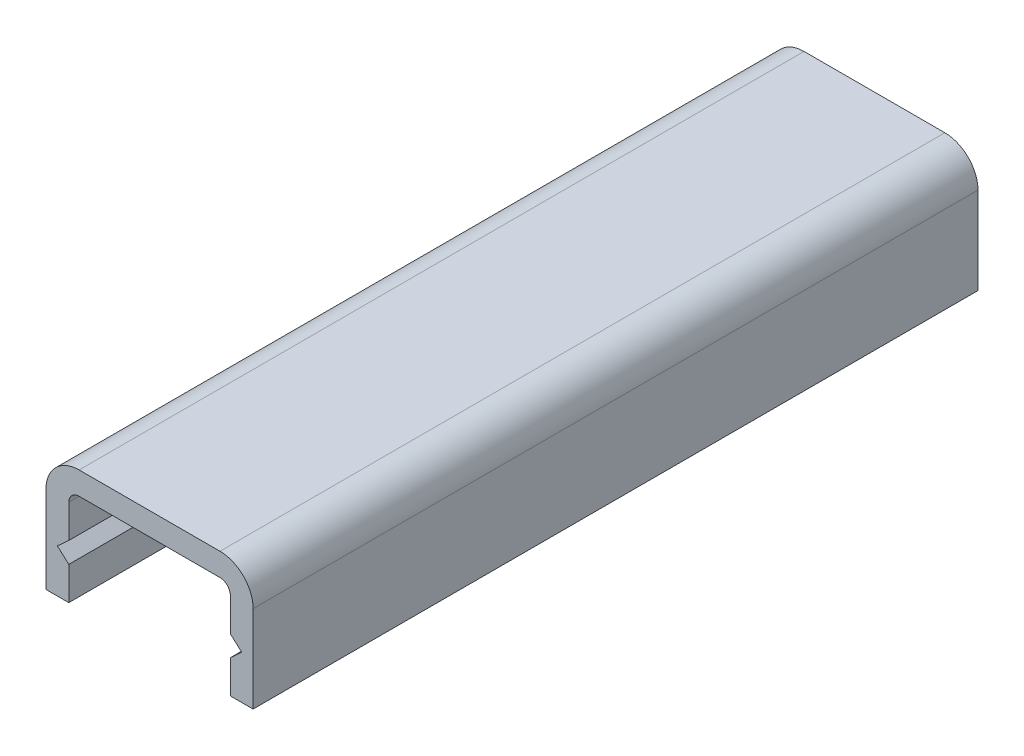
ISO-10303-21;
HEADER;
FILE_DESCRIPTION(('STEP AP214'),'2;1');
FILE_NAME('part.step','',(''),(''),'','','');
FILE_SCHEMA(('AUTOMOTIVE_DESIGN { 1 0 10303 214 1 1 1 1 }'));
ENDSEC;
DATA;
#1=APPLICATION_CONTEXT('core data for automotive mechanical design processes');
#2=APPLICATION_PROTOCOL_DEFINITION('international standard','automotive_design',2000,#1);
#3=PRODUCT_CONTEXT('',#1,'mechanical');
#4=PRODUCT('Part','Part','',(#3));
#5=PRODUCT_RELATED_PRODUCT_CATEGORY('part','',(#4));
#6=PRODUCT_DEFINITION_FORMATION('','',#4);
#7=PRODUCT_DEFINITION_CONTEXT('part definition',#1,'design');
#8=PRODUCT_DEFINITION('design','',#6,#7);
#9=PRODUCT_DEFINITION_SHAPE('','',#8);
#10=(LENGTH_UNIT() NAMED_UNIT(*) SI_UNIT(.MILLI.,.METRE.));
#11=(NAMED_UNIT(*) PLANE_ANGLE_UNIT() SI_UNIT($,.RADIAN.));
#12=(NAMED_UNIT(*) SI_UNIT($,.STERADIAN.) SOLID_ANGLE_UNIT());
#13=UNCERTAINTY_MEASURE_WITH_UNIT(LENGTH_MEASURE(1.E-05),#10,'distance_accuracy_value','');
#14=(GEOMETRIC_REPRESENTATION_CONTEXT(3) GLOBAL_UNCERTAINTY_ASSIGNED_CONTEXT((#13)) GLOBAL_UNIT_ASSIGNED_CONTEXT((#10,
#11,#12)) REPRESENTATION_CONTEXT('',''));
#15=CARTESIAN_POINT('',(0.,0.,0.));
#16=DIRECTION('',(0.,0.,1.));
#17=DIRECTION('',(1.,0.,0.));
#18=AXIS2_PLACEMENT_3D('',#15,#16,#17);
#19=CARTESIAN_POINT('',(0.,-5.8,35.));
#20=DIRECTION('',(0.,1.,0.));
#21=DIRECTION('',(0.,0.,1.));
#22=AXIS2_PLACEMENT_3D('',#19,#20,#21);
#23=PLANE('',#22);
#24=DIRECTION('',(1.,0.,0.));
#25=VECTOR('',#24,1.);
#26=CARTESIAN_POINT('',(0.,-5.8,0.));
#27=LINE('',#26,#25);
#28=CARTESIAN_POINT('',(0.,-5.8,0.));
#29=VERTEX_POINT('',#28);
#30=CARTESIAN_POINT('',(1.1,-5.8,0.));
#31=VERTEX_POINT('',#30);
#32=EDGE_CURVE('E186',#29,#31,#27,.T.);
#33=ORIENTED_EDGE('',*,*,#32,.T.);
#34=DIRECTION('',(0.,0.,-1.));
#35=VECTOR('',#34,1.);
#36=CARTESIAN_POINT('',(1.1,-5.8,35.));
#37=LINE('',#36,#35);
#38=CARTESIAN_POINT('',(1.1,-5.8,35.));
#39=VERTEX_POINT('',#38);
#40=EDGE_CURVE('E11',#39,#31,#37,.T.);
#41=ORIENTED_EDGE('',*,*,#40,.F.);
#42=DIRECTION('',(1.,0.,0.));
#43=VECTOR('',#42,1.);
#44=CARTESIAN_POINT('',(0.,-5.8,35.));
#45=LINE('',#44,#43);
#46=CARTESIAN_POINT('',(0.,-5.8,35.));
#47=VERTEX_POINT('',#46);
#48=EDGE_CURVE('E220',#47,#39,#45,.T.);
#49=ORIENTED_EDGE('',*,*,#48,.F.);
#50=DIRECTION('',(0.,0.,-1.));
#51=VECTOR('',#50,1.);
#52=CARTESIAN_POINT('',(0.,-5.8,35.));
#53=LINE('',#52,#51);
#54=EDGE_CURVE('E182',#47,#29,#53,.T.);
#55=ORIENTED_EDGE('',*,*,#54,.T.);
#56=EDGE_LOOP('',(#33,#41,#49,#55));
#57=FACE_BOUND('',#56,.T.);
#58=ADVANCED_FACE('F30',(#57),#23,.F.);
#59=CARTESIAN_POINT('',(1.1,-4.2,35.));
#60=DIRECTION('',(-1.,0.,0.));
#61=DIRECTION('',(0.,-1.,0.));
#62=AXIS2_PLACEMENT_3D('',#59,#60,#61);
#63=PLANE('',#62);
#64=DIRECTION('',(0.,1.,0.));
#65=VECTOR('',#64,1.);
#66=CARTESIAN_POINT('',(1.1,-4.2,0.));
#67=LINE('',#66,#65);
#68=CARTESIAN_POINT('',(1.1,-4.2,0.));
#69=VERTEX_POINT('',#68);
#70=EDGE_CURVE('E189',#31,#69,#67,.T.);
#71=ORIENTED_EDGE('',*,*,#70,.T.);
#72=DIRECTION('',(0.,0.,-1.));
#73=VECTOR('',#72,1.);
#74=CARTESIAN_POINT('',(1.1,-4.2,35.));
#75=LINE('',#74,#73);
#76=CARTESIAN_POINT('',(1.1,-4.2,35.));
#77=VERTEX_POINT('',#76);
#78=EDGE_CURVE('E38',#77,#69,#75,.T.);
#79=ORIENTED_EDGE('',*,*,#78,.F.);
#80=DIRECTION('',(0.,1.,0.));
#81=VECTOR('',#80,1.);
#82=CARTESIAN_POINT('',(1.1,-4.2,35.));
#83=LINE('',#82,#81);
#84=EDGE_CURVE('E119',#39,#77,#83,.T.);
#85=ORIENTED_EDGE('',*,*,#84,.F.);
#86=ORIENTED_EDGE('',*,*,#40,.T.);
#87=EDGE_LOOP('',(#71,#79,#85,#86));
#88=FACE_BOUND('',#87,.T.);
#89=ADVANCED_FACE('F328',(#88),#63,.F.);
#90=CARTESIAN_POINT('',(1.1,-4.2,35.));
#91=DIRECTION('',(-0.672672793996316,-0.73994007339594,0.));
#92=DIRECTION('',(0.73994007339594,-0.672672793996316,0.));
#93=AXIS2_PLACEMENT_3D('',#90,#91,#92);
#94=PLANE('',#93);
#95=DIRECTION('',(-0.73994007339594,0.672672793996316,0.));
#96=VECTOR('',#95,1.);
#97=CARTESIAN_POINT('',(1.1,-4.2,0.));
#98=LINE('',#97,#96);
#99=CARTESIAN_POINT('',(0.55,-3.7,0.));
#100=VERTEX_POINT('',#99);
#101=EDGE_CURVE('E191',#69,#100,#98,.T.);
#102=ORIENTED_EDGE('',*,*,#101,.T.);
#103=DIRECTION('',(0.,0.,-1.));
#104=VECTOR('',#103,1.);
#105=CARTESIAN_POINT('',(0.55,-3.7,35.));
#106=LINE('',#105,#104);
#107=CARTESIAN_POINT('',(0.55,-3.7,35.));
#108=VERTEX_POINT('',#107);
#109=EDGE_CURVE('E257',#108,#100,#106,.T.);
#110=ORIENTED_EDGE('',*,*,#109,.F.);
#111=DIRECTION('',(-0.73994007339594,0.672672793996316,0.));
#112=VECTOR('',#111,1.);
#113=CARTESIAN_POINT('',(1.1,-4.2,35.));
#114=LINE('',#113,#112);
#115=EDGE_CURVE('E265',#77,#108,#114,.T.);
#116=ORIENTED_EDGE('',*,*,#115,.F.);
#117=ORIENTED_EDGE('',*,*,#78,.T.);
#118=EDGE_LOOP('',(#102,#110,#116,#117));
#119=FACE_BOUND('',#118,.T.);
#120=ADVANCED_FACE('F263',(#119),#94,.F.);
#121=CARTESIAN_POINT('',(1.1,-3.2,35.));
#122=DIRECTION('',(-0.672672793996311,0.739940073395945,0.));
#123=DIRECTION('',(-0.739940073395945,-0.672672793996311,0.));
#124=AXIS2_PLACEMENT_3D('',#121,#122,#123);
#125=PLANE('',#124);
#126=DIRECTION('',(0.739940073395945,0.672672793996311,0.));
#127=VECTOR('',#126,1.);
#128=CARTESIAN_POINT('',(1.1,-3.2,0.));
#129=LINE('',#128,#127);
#130=CARTESIAN_POINT('',(1.1,-3.2,0.));
#131=VERTEX_POINT('',#130);
#132=EDGE_CURVE('E193',#100,#131,#129,.T.);
#133=ORIENTED_EDGE('',*,*,#132,.T.);
#134=DIRECTION('',(0.,0.,-1.));
#135=VECTOR('',#134,1.);
#136=CARTESIAN_POINT('',(1.1,-3.2,35.));
#137=LINE('',#136,#135);
#138=CARTESIAN_POINT('',(1.1,-3.2,35.));
#139=VERTEX_POINT('',#138);
#140=EDGE_CURVE('E254',#139,#131,#137,.T.);
#141=ORIENTED_EDGE('',*,*,#140,.F.);
#142=DIRECTION('',(0.739940073395945,0.672672793996311,0.));
#143=VECTOR('',#142,1.);
#144=CARTESIAN_POINT('',(1.1,-3.2,35.));
#145=LINE('',#144,#143);
#146=EDGE_CURVE('E283',#108,#139,#145,.T.);
#147=ORIENTED_EDGE('',*,*,#146,.F.);
#148=ORIENTED_EDGE('',*,*,#109,.T.);
#149=EDGE_LOOP('',(#133,#141,#147,#148));
#150=FACE_BOUND('',#149,.T.);
#151=ADVANCED_FACE('F274',(#150),#125,.F.);
#152=CARTESIAN_POINT('',(1.1,-1.6,35.));
#153=DIRECTION('',(-1.,0.,0.));
#154=DIRECTION('',(0.,0.,1.));
#155=AXIS2_PLACEMENT_3D('',#152,#153,#154);
#156=PLANE('',#155);
#157=DIRECTION('',(0.,1.,0.));
#158=VECTOR('',#157,1.);
#159=CARTESIAN_POINT('',(1.1,-1.6,0.));
#160=LINE('',#159,#158);
#161=CARTESIAN_POINT('',(1.1,-1.6,0.));
#162=VERTEX_POINT('',#161);
#163=EDGE_CURVE('E195',#131,#162,#160,.T.);
#164=ORIENTED_EDGE('',*,*,#163,.T.);
#165=DIRECTION('',(0.,0.,-1.));
#166=VECTOR('',#165,1.);
#167=CARTESIAN_POINT('',(1.1,-1.6,35.));
#168=LINE('',#167,#166);
#169=CARTESIAN_POINT('',(1.1,-1.6,35.));
#170=VERTEX_POINT('',#169);
#171=EDGE_CURVE('E251',#170,#162,#168,.T.);
#172=ORIENTED_EDGE('',*,*,#171,.F.);
#173=DIRECTION('',(0.,1.,0.));
#174=VECTOR('',#173,1.);
#175=CARTESIAN_POINT('',(1.1,-1.6,35.));
#176=LINE('',#175,#174);
#177=EDGE_CURVE('E280',#139,#170,#176,.T.);
#178=ORIENTED_EDGE('',*,*,#177,.F.);
#179=ORIENTED_EDGE('',*,*,#140,.T.);
#180=EDGE_LOOP('',(#164,#172,#178,#179));
#181=FACE_BOUND('',#180,.T.);
#182=ADVANCED_FACE('F278',(#181),#156,.F.);
#183=CARTESIAN_POINT('',(1.6,-1.6,35.));
#184=DIRECTION('',(0.,0.,-1.));
#185=DIRECTION('',(-1.,0.,0.));
#186=AXIS2_PLACEMENT_3D('',#183,#184,#185);
#187=CYLINDRICAL_SURFACE('',#186,0.5);
#188=CARTESIAN_POINT('',(1.6,-1.6,0.));
#189=DIRECTION('',(0.,0.,-1.));
#190=DIRECTION('',(1.,0.,0.));
#191=AXIS2_PLACEMENT_3D('',#188,#189,#190);
#192=CIRCLE('',#191,0.5);
#193=CARTESIAN_POINT('',(1.6,-1.1,0.));
#194=VERTEX_POINT('',#193);
#195=EDGE_CURVE('E197',#162,#194,#192,.T.);
#196=ORIENTED_EDGE('',*,*,#195,.T.);
#197=DIRECTION('',(0.,0.,-1.));
#198=VECTOR('',#197,1.);
#199=CARTESIAN_POINT('',(1.6,-1.1,35.));
#200=LINE('',#199,#198);
#201=CARTESIAN_POINT('',(1.6,-1.1,35.));
#202=VERTEX_POINT('',#201);
#203=EDGE_CURVE('E248',#202,#194,#200,.T.);
#204=ORIENTED_EDGE('',*,*,#203,.F.);
#205=CARTESIAN_POINT('',(1.6,-1.6,35.));
#206=DIRECTION('',(0.,0.,-1.));
#207=DIRECTION('',(1.,0.,0.));
#208=AXIS2_PLACEMENT_3D('',#205,#206,#207);
#209=CIRCLE('',#208,0.5);
#210=EDGE_CURVE('E282',#170,#202,#209,.T.);
#211=ORIENTED_EDGE('',*,*,#210,.F.);
#212=ORIENTED_EDGE('',*,*,#171,.T.);
#213=EDGE_LOOP('',(#196,#204,#211,#212));
#214=FACE_BOUND('',#213,.T.);
#215=ADVANCED_FACE('F341',(#214),#187,.F.);
#216=CARTESIAN_POINT('',(1.6,-1.1,35.));
#217=DIRECTION('',(0.,1.,0.));
#218=DIRECTION('',(0.,0.,1.));
#219=AXIS2_PLACEMENT_3D('',#216,#217,#218);
#220=PLANE('',#219);
#221=DIRECTION('',(1.,0.,0.));
#222=VECTOR('',#221,1.);
#223=CARTESIAN_POINT('',(1.6,-1.1,0.));
#224=LINE('',#223,#222);
#225=CARTESIAN_POINT('',(8.4,-1.1,0.));
#226=VERTEX_POINT('',#225);
#227=EDGE_CURVE('E199',#194,#226,#224,.T.);
#228=ORIENTED_EDGE('',*,*,#227,.T.);
#229=DIRECTION('',(0.,0.,-1.));
#230=VECTOR('',#229,1.);
#231=CARTESIAN_POINT('',(8.4,-1.1,35.));
#232=LINE('',#231,#230);
#233=CARTESIAN_POINT('',(8.4,-1.1,35.));
#234=VERTEX_POINT('',#233);
#235=EDGE_CURVE('E245',#234,#226,#232,.T.);
#236=ORIENTED_EDGE('',*,*,#235,.F.);
#237=DIRECTION('',(1.,0.,0.));
#238=VECTOR('',#237,1.);
#239=CARTESIAN_POINT('',(1.6,-1.1,35.));
#240=LINE('',#239,#238);
#241=EDGE_CURVE('E285',#202,#234,#240,.T.);
#242=ORIENTED_EDGE('',*,*,#241,.F.);
#243=ORIENTED_EDGE('',*,*,#203,.T.);
#244=EDGE_LOOP('',(#228,#236,#242,#243));
#245=FACE_BOUND('',#244,.T.);
#246=ADVANCED_FACE('F344',(#245),#220,.F.);
#247=CARTESIAN_POINT('',(8.4,-1.6,35.));
#248=DIRECTION('',(0.,0.,-1.));
#249=DIRECTION('',(-1.,0.,0.));
#250=AXIS2_PLACEMENT_3D('',#247,#248,#249);
#251=CYLINDRICAL_SURFACE('',#250,0.5);
#252=CARTESIAN_POINT('',(8.4,-1.6,0.));
#253=DIRECTION('',(0.,0.,-1.));
#254=DIRECTION('',(1.,0.,0.));
#255=AXIS2_PLACEMENT_3D('',#252,#253,#254);
#256=CIRCLE('',#255,0.5);
#257=CARTESIAN_POINT('',(8.9,-1.6,0.));
#258=VERTEX_POINT('',#257);
#259=EDGE_CURVE('E201',#226,#258,#256,.T.);
#260=ORIENTED_EDGE('',*,*,#259,.T.);
#261=DIRECTION('',(0.,0.,-1.));
#262=VECTOR('',#261,1.);
#263=CARTESIAN_POINT('',(8.9,-1.6,35.));
#264=LINE('',#263,#262);
#265=CARTESIAN_POINT('',(8.9,-1.6,35.));
#266=VERTEX_POINT('',#265);
#267=EDGE_CURVE('E242',#266,#258,#264,.T.);
#268=ORIENTED_EDGE('',*,*,#267,.F.);
#269=CARTESIAN_POINT('',(8.4,-1.6,35.));
#270=DIRECTION('',(0.,0.,-1.));
#271=DIRECTION('',(1.,0.,0.));
#272=AXIS2_PLACEMENT_3D('',#269,#270,#271);
#273=CIRCLE('',#272,0.5);
#274=EDGE_CURVE('E291',#234,#266,#273,.T.);
#275=ORIENTED_EDGE('',*,*,#274,.F.);
#276=ORIENTED_EDGE('',*,*,#235,.T.);
#277=EDGE_LOOP('',(#260,#268,#275,#276));
#278=FACE_BOUND('',#277,.T.);
#279=ADVANCED_FACE('F348',(#278),#251,.F.);
#280=CARTESIAN_POINT('',(8.9,-1.6,35.));
#281=DIRECTION('',(1.,0.,0.));
#282=DIRECTION('',(0.,1.,0.));
#283=AXIS2_PLACEMENT_3D('',#280,#281,#282);
#284=PLANE('',#283);
#285=DIRECTION('',(0.,-1.,0.));
#286=VECTOR('',#285,1.);
#287=CARTESIAN_POINT('',(8.9,-1.6,0.));
#288=LINE('',#287,#286);
#289=CARTESIAN_POINT('',(8.9,-3.2,0.));
#290=VERTEX_POINT('',#289);
#291=EDGE_CURVE('E203',#258,#290,#288,.T.);
#292=ORIENTED_EDGE('',*,*,#291,.T.);
#293=DIRECTION('',(0.,0.,-1.));
#294=VECTOR('',#293,1.);
#295=CARTESIAN_POINT('',(8.9,-3.2,35.));
#296=LINE('',#295,#294);
#297=CARTESIAN_POINT('',(8.9,-3.2,35.));
#298=VERTEX_POINT('',#297);
#299=EDGE_CURVE('E239',#298,#290,#296,.T.);
#300=ORIENTED_EDGE('',*,*,#299,.F.);
#301=DIRECTION('',(0.,-1.,0.));
#302=VECTOR('',#301,1.);
#303=CARTESIAN_POINT('',(8.9,-1.6,35.));
#304=LINE('',#303,#302);
#305=EDGE_CURVE('E293',#266,#298,#304,.T.);
#306=ORIENTED_EDGE('',*,*,#305,.F.);
#307=ORIENTED_EDGE('',*,*,#267,.T.);
#308=EDGE_LOOP('',(#292,#300,#306,#307));
#309=FACE_BOUND('',#308,.T.);
#310=ADVANCED_FACE('F352',(#309),#284,.F.);
#311=CARTESIAN_POINT('',(8.9,-3.2,35.));
#312=DIRECTION('',(0.672672793996311,0.739940073395945,0.));
#313=DIRECTION('',(-0.739940073395945,0.672672793996311,0.));
#314=AXIS2_PLACEMENT_3D('',#311,#312,#313);
#315=PLANE('',#314);
#316=DIRECTION('',(0.739940073395945,-0.672672793996311,0.));
#317=VECTOR('',#316,1.);
#318=CARTESIAN_POINT('',(8.9,-3.2,0.));
#319=LINE('',#318,#317);
#320=CARTESIAN_POINT('',(9.45,-3.7,0.));
#321=VERTEX_POINT('',#320);
#322=EDGE_CURVE('E205',#290,#321,#319,.T.);
#323=ORIENTED_EDGE('',*,*,#322,.T.);
#324=DIRECTION('',(0.,0.,-1.));
#325=VECTOR('',#324,1.);
#326=CARTESIAN_POINT('',(9.45,-3.7,35.));
#327=LINE('',#326,#325);
#328=CARTESIAN_POINT('',(9.45,-3.7,35.));
#329=VERTEX_POINT('',#328);
#330=EDGE_CURVE('E236',#329,#321,#327,.T.);
#331=ORIENTED_EDGE('',*,*,#330,.F.);
#332=DIRECTION('',(0.739940073395945,-0.672672793996311,0.));
#333=VECTOR('',#332,1.);
#334=CARTESIAN_POINT('',(8.9,-3.2,35.));
#335=LINE('',#334,#333);
#336=EDGE_CURVE('E295',#298,#329,#335,.T.);
#337=ORIENTED_EDGE('',*,*,#336,.F.);
#338=ORIENTED_EDGE('',*,*,#299,.T.);
#339=EDGE_LOOP('',(#323,#331,#337,#338));
#340=FACE_BOUND('',#339,.T.);
#341=ADVANCED_FACE('F356',(#340),#315,.F.);
#342=CARTESIAN_POINT('',(8.9,-4.2,35.));
#343=DIRECTION('',(0.672672793996316,-0.73994007339594,0.));
#344=DIRECTION('',(0.739940073395941,0.672672793996316,0.));
#345=AXIS2_PLACEMENT_3D('',#342,#343,#344);
#346=PLANE('',#345);
#347=DIRECTION('',(-0.73994007339594,-0.672672793996316,0.));
#348=VECTOR('',#347,1.);
#349=CARTESIAN_POINT('',(8.9,-4.2,0.));
#350=LINE('',#349,#348);
#351=CARTESIAN_POINT('',(8.9,-4.2,0.));
#352=VERTEX_POINT('',#351);
#353=EDGE_CURVE('E207',#321,#352,#350,.T.);
#354=ORIENTED_EDGE('',*,*,#353,.T.);
#355=DIRECTION('',(0.,0.,-1.));
#356=VECTOR('',#355,1.);
#357=CARTESIAN_POINT('',(8.9,-4.2,35.));
#358=LINE('',#357,#356);
#359=CARTESIAN_POINT('',(8.9,-4.2,35.));
#360=VERTEX_POINT('',#359);
#361=EDGE_CURVE('E233',#360,#352,#358,.T.);
#362=ORIENTED_EDGE('',*,*,#361,.F.);
#363=DIRECTION('',(-0.73994007339594,-0.672672793996316,0.));
#364=VECTOR('',#363,1.);
#365=CARTESIAN_POINT('',(8.9,-4.2,35.));
#366=LINE('',#365,#364);
#367=EDGE_CURVE('E297',#329,#360,#366,.T.);
#368=ORIENTED_EDGE('',*,*,#367,.F.);
#369=ORIENTED_EDGE('',*,*,#330,.T.);
#370=EDGE_LOOP('',(#354,#362,#368,#369));
#371=FACE_BOUND('',#370,.T.);
#372=ADVANCED_FACE('F360',(#371),#346,.F.);
#373=CARTESIAN_POINT('',(8.9,-4.2,35.));
#374=DIRECTION('',(1.,0.,0.));
#375=DIRECTION('',(0.,1.,0.));
#376=AXIS2_PLACEMENT_3D('',#373,#374,#375);
#377=PLANE('',#376);
#378=DIRECTION('',(0.,-1.,0.));
#379=VECTOR('',#378,1.);
#380=CARTESIAN_POINT('',(8.9,-4.2,0.));
#381=LINE('',#380,#379);
#382=CARTESIAN_POINT('',(8.9,-5.8,0.));
#383=VERTEX_POINT('',#382);
#384=EDGE_CURVE('E209',#352,#383,#381,.T.);
#385=ORIENTED_EDGE('',*,*,#384,.T.);
#386=DIRECTION('',(0.,0.,-1.));
#387=VECTOR('',#386,1.);
#388=CARTESIAN_POINT('',(8.9,-5.8,35.));
#389=LINE('',#388,#387);
#390=CARTESIAN_POINT('',(8.9,-5.8,35.));
#391=VERTEX_POINT('',#390);
#392=EDGE_CURVE('E230',#391,#383,#389,.T.);
#393=ORIENTED_EDGE('',*,*,#392,.F.);
#394=DIRECTION('',(0.,-1.,0.));
#395=VECTOR('',#394,1.);
#396=CARTESIAN_POINT('',(8.9,-4.2,35.));
#397=LINE('',#396,#395);
#398=EDGE_CURVE('E299',#360,#391,#397,.T.);
#399=ORIENTED_EDGE('',*,*,#398,.F.);
#400=ORIENTED_EDGE('',*,*,#361,.T.);
#401=EDGE_LOOP('',(#385,#393,#399,#400));
#402=FACE_BOUND('',#401,.T.);
#403=ADVANCED_FACE('F364',(#402),#377,.F.);
#404=CARTESIAN_POINT('',(10.,-5.8,35.));
#405=DIRECTION('',(0.,1.,0.));
#406=DIRECTION('',(0.,0.,1.));
#407=AXIS2_PLACEMENT_3D('',#404,#405,#406);
#408=PLANE('',#407);
#409=DIRECTION('',(1.,0.,0.));
#410=VECTOR('',#409,1.);
#411=CARTESIAN_POINT('',(10.,-5.8,0.));
#412=LINE('',#411,#410);
#413=CARTESIAN_POINT('',(10.,-5.8,0.));
#414=VERTEX_POINT('',#413);
#415=EDGE_CURVE('E211',#383,#414,#412,.T.);
#416=ORIENTED_EDGE('',*,*,#415,.T.);
#417=DIRECTION('',(0.,0.,-1.));
#418=VECTOR('',#417,1.);
#419=CARTESIAN_POINT('',(10.,-5.8,35.));
#420=LINE('',#419,#418);
#421=CARTESIAN_POINT('',(10.,-5.8,35.));
#422=VERTEX_POINT('',#421);
#423=EDGE_CURVE('E227',#422,#414,#420,.T.);
#424=ORIENTED_EDGE('',*,*,#423,.F.);
#425=DIRECTION('',(1.,0.,0.));
#426=VECTOR('',#425,1.);
#427=CARTESIAN_POINT('',(10.,-5.8,35.));
#428=LINE('',#427,#426);
#429=EDGE_CURVE('E301',#391,#422,#428,.T.);
#430=ORIENTED_EDGE('',*,*,#429,.F.);
#431=ORIENTED_EDGE('',*,*,#392,.T.);
#432=EDGE_LOOP('',(#416,#424,#430,#431));
#433=FACE_BOUND('',#432,.T.);
#434=ADVANCED_FACE('F368',(#433),#408,.F.);
#435=CARTESIAN_POINT('',(10.,-1.60000000000001,35.));
#436=DIRECTION('',(-1.,0.,0.));
#437=DIRECTION('',(0.,0.,1.));
#438=AXIS2_PLACEMENT_3D('',#435,#436,#437);
#439=PLANE('',#438);
#440=DIRECTION('',(0.,1.,0.));
#441=VECTOR('',#440,1.);
#442=CARTESIAN_POINT('',(10.,-1.60000000000001,0.));
#443=LINE('',#442,#441);
#444=CARTESIAN_POINT('',(10.,-1.60000000000001,0.));
#445=VERTEX_POINT('',#444);
#446=EDGE_CURVE('E213',#414,#445,#443,.T.);
#447=ORIENTED_EDGE('',*,*,#446,.T.);
#448=DIRECTION('',(0.,0.,-1.));
#449=VECTOR('',#448,1.);
#450=CARTESIAN_POINT('',(10.,-1.60000000000001,35.));
#451=LINE('',#450,#449);
#452=CARTESIAN_POINT('',(10.,-1.60000000000001,35.));
#453=VERTEX_POINT('',#452);
#454=EDGE_CURVE('E224',#453,#445,#451,.T.);
#455=ORIENTED_EDGE('',*,*,#454,.F.);
#456=DIRECTION('',(0.,1.,0.));
#457=VECTOR('',#456,1.);
#458=CARTESIAN_POINT('',(10.,-1.60000000000001,35.));
#459=LINE('',#458,#457);
#460=EDGE_CURVE('E303',#422,#453,#459,.T.);
#461=ORIENTED_EDGE('',*,*,#460,.F.);
#462=ORIENTED_EDGE('',*,*,#423,.T.);
#463=EDGE_LOOP('',(#447,#455,#461,#462));
#464=FACE_BOUND('',#463,.T.);
#465=ADVANCED_FACE('F309',(#464),#439,.F.);
#466=CARTESIAN_POINT('',(8.4,-1.6,35.));
#467=DIRECTION('',(0.,0.,-1.));
#468=DIRECTION('',(-1.,0.,0.));
#469=AXIS2_PLACEMENT_3D('',#466,#467,#468);
#470=CYLINDRICAL_SURFACE('',#469,1.6);
#471=CARTESIAN_POINT('',(8.4,-1.6,0.));
#472=DIRECTION('',(0.,0.,1.));
#473=DIRECTION('',(-1.,0.,0.));
#474=AXIS2_PLACEMENT_3D('',#471,#472,#473);
#475=CIRCLE('',#474,1.6);
#476=CARTESIAN_POINT('',(8.39999999999999,0.,0.));
#477=VERTEX_POINT('',#476);
#478=EDGE_CURVE('E215',#445,#477,#475,.T.);
#479=ORIENTED_EDGE('',*,*,#478,.T.);
#480=DIRECTION('',(0.,0.,-1.));
#481=VECTOR('',#480,1.);
#482=CARTESIAN_POINT('',(8.39999999999999,0.,35.));
#483=LINE('',#482,#481);
#484=CARTESIAN_POINT('',(8.39999999999999,0.,35.));
#485=VERTEX_POINT('',#484);
#486=EDGE_CURVE('E177',#485,#477,#483,.T.);
#487=ORIENTED_EDGE('',*,*,#486,.F.);
#488=CARTESIAN_POINT('',(8.4,-1.6,35.));
#489=DIRECTION('',(0.,0.,1.));
#490=DIRECTION('',(-1.,0.,0.));
#491=AXIS2_PLACEMENT_3D('',#488,#489,#490);
#492=CIRCLE('',#491,1.6);
#493=EDGE_CURVE('E168',#453,#485,#492,.T.);
#494=ORIENTED_EDGE('',*,*,#493,.F.);
#495=ORIENTED_EDGE('',*,*,#454,.T.);
#496=EDGE_LOOP('',(#479,#487,#494,#495));
#497=FACE_BOUND('',#496,.T.);
#498=ADVANCED_FACE('F313',(#497),#470,.T.);
#499=CARTESIAN_POINT('',(1.60000000000001,0.,35.));
#500=DIRECTION('',(0.,-1.,0.));
#501=DIRECTION('',(0.,0.,-1.));
#502=AXIS2_PLACEMENT_3D('',#499,#500,#501);
#503=PLANE('',#502);
#504=DIRECTION('',(-1.,0.,0.));
#505=VECTOR('',#504,1.);
#506=CARTESIAN_POINT('',(1.60000000000001,0.,0.));
#507=LINE('',#506,#505);
#508=CARTESIAN_POINT('',(1.60000000000001,0.,0.));
#509=VERTEX_POINT('',#508);
#510=EDGE_CURVE('E176',#477,#509,#507,.T.);
#511=ORIENTED_EDGE('',*,*,#510,.T.);
#512=DIRECTION('',(0.,0.,-1.));
#513=VECTOR('',#512,1.);
#514=CARTESIAN_POINT('',(1.60000000000001,0.,35.));
#515=LINE('',#514,#513);
#516=CARTESIAN_POINT('',(1.60000000000001,0.,35.));
#517=VERTEX_POINT('',#516);
#518=EDGE_CURVE('E173',#517,#509,#515,.T.);
#519=ORIENTED_EDGE('',*,*,#518,.F.);
#520=DIRECTION('',(-1.,0.,0.));
#521=VECTOR('',#520,1.);
#522=CARTESIAN_POINT('',(1.60000000000001,0.,35.));
#523=LINE('',#522,#521);
#524=EDGE_CURVE('E162',#485,#517,#523,.T.);
#525=ORIENTED_EDGE('',*,*,#524,.F.);
#526=ORIENTED_EDGE('',*,*,#486,.T.);
#527=EDGE_LOOP('',(#511,#519,#525,#526));
#528=FACE_BOUND('',#527,.T.);
#529=ADVANCED_FACE('F174',(#528),#503,.F.);
#530=CARTESIAN_POINT('',(1.6,-1.6,35.));
#531=DIRECTION('',(0.,0.,-1.));
#532=DIRECTION('',(-1.,0.,0.));
#533=AXIS2_PLACEMENT_3D('',#530,#531,#532);
#534=CYLINDRICAL_SURFACE('',#533,1.6);
#535=CARTESIAN_POINT('',(1.6,-1.6,0.));
#536=DIRECTION('',(0.,0.,1.));
#537=DIRECTION('',(-1.,0.,0.));
#538=AXIS2_PLACEMENT_3D('',#535,#536,#537);
#539=CIRCLE('',#538,1.6);
#540=CARTESIAN_POINT('',(0.,-1.60000000000001,0.));
#541=VERTEX_POINT('',#540);
#542=EDGE_CURVE('E105',#509,#541,#539,.T.);
#543=ORIENTED_EDGE('',*,*,#542,.T.);
#544=DIRECTION('',(0.,0.,-1.));
#545=VECTOR('',#544,1.);
#546=CARTESIAN_POINT('',(0.,-1.60000000000001,35.));
#547=LINE('',#546,#545);
#548=CARTESIAN_POINT('',(0.,-1.60000000000001,35.));
#549=VERTEX_POINT('',#548);
#550=EDGE_CURVE('E178',#549,#541,#547,.T.);
#551=ORIENTED_EDGE('',*,*,#550,.F.);
#552=CARTESIAN_POINT('',(1.6,-1.6,35.));
#553=DIRECTION('',(0.,0.,1.));
#554=DIRECTION('',(-1.,0.,0.));
#555=AXIS2_PLACEMENT_3D('',#552,#553,#554);
#556=CIRCLE('',#555,1.6);
#557=EDGE_CURVE('E166',#517,#549,#556,.T.);
#558=ORIENTED_EDGE('',*,*,#557,.F.);
#559=ORIENTED_EDGE('',*,*,#518,.T.);
#560=EDGE_LOOP('',(#543,#551,#558,#559));
#561=FACE_BOUND('',#560,.T.);
#562=ADVANCED_FACE('F180',(#561),#534,.T.);
#563=CARTESIAN_POINT('',(0.,-1.60000000000001,35.));
#564=DIRECTION('',(1.,0.,0.));
#565=DIRECTION('',(0.,0.,-1.));
#566=AXIS2_PLACEMENT_3D('',#563,#564,#565);
#567=PLANE('',#566);
#568=DIRECTION('',(0.,-1.,0.));
#569=VECTOR('',#568,1.);
#570=CARTESIAN_POINT('',(0.,-1.60000000000001,0.));
#571=LINE('',#570,#569);
#572=EDGE_CURVE('E111',#541,#29,#571,.T.);
#573=ORIENTED_EDGE('',*,*,#572,.T.);
#574=ORIENTED_EDGE('',*,*,#54,.F.);
#575=DIRECTION('',(0.,-1.,0.));
#576=VECTOR('',#575,1.);
#577=CARTESIAN_POINT('',(0.,-1.60000000000001,35.));
#578=LINE('',#577,#576);
#579=EDGE_CURVE('E46',#549,#47,#578,.T.);
#580=ORIENTED_EDGE('',*,*,#579,.F.);
#581=ORIENTED_EDGE('',*,*,#550,.T.);
#582=EDGE_LOOP('',(#573,#574,#580,#581));
#583=FACE_BOUND('',#582,.T.);
#584=ADVANCED_FACE('F317',(#583),#567,.F.);
#585=CARTESIAN_POINT('',(1.6,-1.6,35.));
#586=DIRECTION('',(0.,0.,1.));
#587=DIRECTION('',(1.,0.,0.));
#588=AXIS2_PLACEMENT_3D('',#585,#586,#587);
#589=PLANE('',#588);
#590=ORIENTED_EDGE('',*,*,#48,.T.);
#591=ORIENTED_EDGE('',*,*,#84,.T.);
#592=ORIENTED_EDGE('',*,*,#115,.T.);
#593=ORIENTED_EDGE('',*,*,#146,.T.);
#594=ORIENTED_EDGE('',*,*,#177,.T.);
#595=ORIENTED_EDGE('',*,*,#210,.T.);
#596=ORIENTED_EDGE('',*,*,#241,.T.);
#597=ORIENTED_EDGE('',*,*,#274,.T.);
#598=ORIENTED_EDGE('',*,*,#305,.T.);
#599=ORIENTED_EDGE('',*,*,#336,.T.);
#600=ORIENTED_EDGE('',*,*,#367,.T.);
#601=ORIENTED_EDGE('',*,*,#398,.T.);
#602=ORIENTED_EDGE('',*,*,#429,.T.);
#603=ORIENTED_EDGE('',*,*,#460,.T.);
#604=ORIENTED_EDGE('',*,*,#493,.T.);
#605=ORIENTED_EDGE('',*,*,#524,.T.);
#606=ORIENTED_EDGE('',*,*,#557,.T.);
#607=ORIENTED_EDGE('',*,*,#579,.T.);
#608=EDGE_LOOP('',(#590,#591,#592,#593,#594,#595,#596,#597,#598,#599,#600,#601,#602,#603,#604,
#605,#606,#607));
#609=FACE_BOUND('',#608,.T.);
#610=ADVANCED_FACE('F164',(#609),#589,.T.);
#611=CARTESIAN_POINT('',(1.6,-1.6,0.));
#612=DIRECTION('',(0.,0.,1.));
#613=DIRECTION('',(1.,0.,0.));
#614=AXIS2_PLACEMENT_3D('',#611,#612,#613);
#615=PLANE('',#614);
#616=ORIENTED_EDGE('',*,*,#32,.F.);
#617=ORIENTED_EDGE('',*,*,#572,.F.);
#618=ORIENTED_EDGE('',*,*,#542,.F.);
#619=ORIENTED_EDGE('',*,*,#510,.F.);
#620=ORIENTED_EDGE('',*,*,#478,.F.);
#621=ORIENTED_EDGE('',*,*,#446,.F.);
#622=ORIENTED_EDGE('',*,*,#415,.F.);
#623=ORIENTED_EDGE('',*,*,#384,.F.);
#624=ORIENTED_EDGE('',*,*,#353,.F.);
#625=ORIENTED_EDGE('',*,*,#322,.F.);
#626=ORIENTED_EDGE('',*,*,#291,.F.);
#627=ORIENTED_EDGE('',*,*,#259,.F.);
#628=ORIENTED_EDGE('',*,*,#227,.F.);
#629=ORIENTED_EDGE('',*,*,#195,.F.);
#630=ORIENTED_EDGE('',*,*,#163,.F.);
#631=ORIENTED_EDGE('',*,*,#132,.F.);
#632=ORIENTED_EDGE('',*,*,#101,.F.);
#633=ORIENTED_EDGE('',*,*,#70,.F.);
#634=EDGE_LOOP('',(#616,#617,#618,#619,#620,#621,#622,#623,#624,#625,#626,#627,#628,#629,#630,
#631,#632,#633));
#635=FACE_BOUND('',#634,.T.);
#636=ADVANCED_FACE('F269',(#635),#615,.F.);
#637=CLOSED_SHELL('',(#58,#89,#120,#151,#182,#215,#246,#279,#310,#341,#372,#403,#434,#465,#498,
#529,#562,#584,#610,#636));
#638=MANIFOLD_SOLID_BREP('B2',#637);
#639=ADVANCED_BREP_SHAPE_REPRESENTATION('',(#18,#638),#14);
#640=SHAPE_DEFINITION_REPRESENTATION(#9,#639);
ENDSEC;
END-ISO-10303-21;
